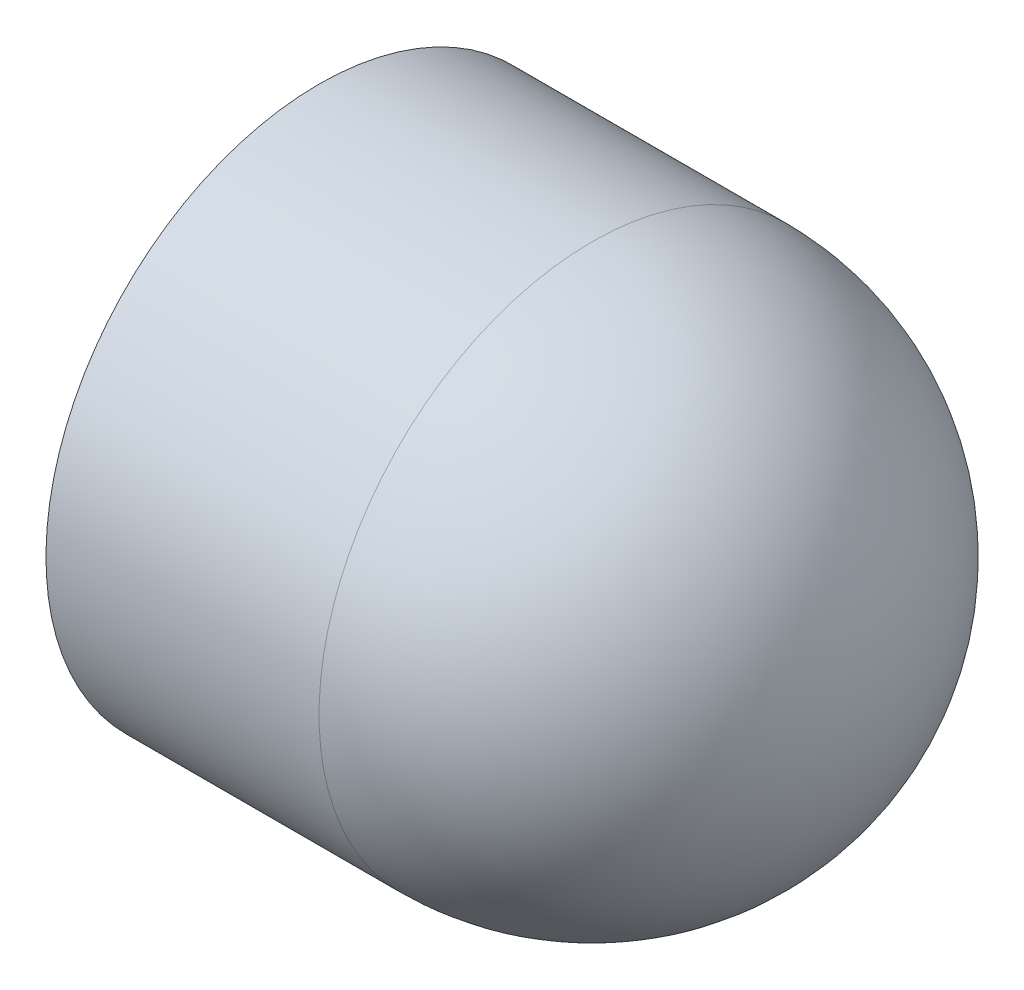
ISO-10303-21;
HEADER;
FILE_DESCRIPTION(('STEP AP214'),'2;1');
FILE_NAME('part.step','',(''),(''),'','','');
FILE_SCHEMA(('AUTOMOTIVE_DESIGN { 1 0 10303 214 1 1 1 1 }'));
ENDSEC;
DATA;
#1=APPLICATION_CONTEXT('core data for automotive mechanical design processes');
#2=APPLICATION_PROTOCOL_DEFINITION('international standard','automotive_design',2000,#1);
#3=PRODUCT_CONTEXT('',#1,'mechanical');
#4=PRODUCT('Part','Part','',(#3));
#5=PRODUCT_RELATED_PRODUCT_CATEGORY('part','',(#4));
#6=PRODUCT_DEFINITION_FORMATION('','',#4);
#7=PRODUCT_DEFINITION_CONTEXT('part definition',#1,'design');
#8=PRODUCT_DEFINITION('design','',#6,#7);
#9=PRODUCT_DEFINITION_SHAPE('','',#8);
#10=(LENGTH_UNIT() NAMED_UNIT(*) SI_UNIT(.MILLI.,.METRE.));
#11=(NAMED_UNIT(*) PLANE_ANGLE_UNIT() SI_UNIT($,.RADIAN.));
#12=(NAMED_UNIT(*) SI_UNIT($,.STERADIAN.) SOLID_ANGLE_UNIT());
#13=UNCERTAINTY_MEASURE_WITH_UNIT(LENGTH_MEASURE(1.E-05),#10,'distance_accuracy_value','');
#14=(GEOMETRIC_REPRESENTATION_CONTEXT(3) GLOBAL_UNCERTAINTY_ASSIGNED_CONTEXT((#13)) GLOBAL_UNIT_ASSIGNED_CONTEXT((#10,
#11,#12)) REPRESENTATION_CONTEXT('',''));
#15=CARTESIAN_POINT('',(0.,0.,0.));
#16=DIRECTION('',(0.,0.,1.));
#17=DIRECTION('',(1.,0.,0.));
#18=AXIS2_PLACEMENT_3D('',#15,#16,#17);
#19=CARTESIAN_POINT('',(0.,0.,0.));
#20=DIRECTION('',(-1.,0.,0.));
#21=DIRECTION('',(0.,-1.,0.));
#22=AXIS2_PLACEMENT_3D('',#19,#20,#21);
#23=PLANE('',#22);
#24=CARTESIAN_POINT('',(0.,0.,0.));
#25=DIRECTION('',(1.,0.,0.));
#26=DIRECTION('',(0.,1.,0.));
#27=AXIS2_PLACEMENT_3D('',#24,#25,#26);
#28=CIRCLE('',#27,0.8);
#29=CARTESIAN_POINT('',(0.,0.8,0.));
#30=VERTEX_POINT('',#29);
#31=EDGE_CURVE('E19',#30,#30,#28,.F.);
#32=ORIENTED_EDGE('',*,*,#31,.T.);
#33=EDGE_LOOP('',(#32));
#34=FACE_BOUND('',#33,.T.);
#35=ADVANCED_FACE('F16',(#34),#23,.T.);
#36=CARTESIAN_POINT('',(1.2,0.,0.));
#37=DIRECTION('',(1.,0.,0.));
#38=DIRECTION('',(0.,1.,0.));
#39=AXIS2_PLACEMENT_3D('',#36,#37,#38);
#40=CYLINDRICAL_SURFACE('',#39,0.8);
#41=ORIENTED_EDGE('',*,*,#31,.F.);
#42=EDGE_LOOP('',(#41));
#43=FACE_BOUND('',#42,.T.);
#44=CARTESIAN_POINT('',(-3.,0.,0.));
#45=DIRECTION('',(1.,0.,0.));
#46=DIRECTION('',(0.,1.,0.));
#47=AXIS2_PLACEMENT_3D('',#44,#45,#46);
#48=CIRCLE('',#47,0.8);
#49=CARTESIAN_POINT('',(-3.,0.8,0.));
#50=VERTEX_POINT('',#49);
#51=EDGE_CURVE('E35',#50,#50,#48,.T.);
#52=ORIENTED_EDGE('',*,*,#51,.F.);
#53=EDGE_LOOP('',(#52));
#54=FACE_BOUND('',#53,.T.);
#55=ADVANCED_FACE('F47',(#43,#54),#40,.F.);
#56=CARTESIAN_POINT('',(-3.,0.8,0.));
#57=DIRECTION('',(-1.,0.,0.));
#58=DIRECTION('',(0.,-1.,0.));
#59=AXIS2_PLACEMENT_3D('',#56,#57,#58);
#60=PLANE('',#59);
#61=CARTESIAN_POINT('',(-3.,0.,0.));
#62=DIRECTION('',(1.,0.,0.));
#63=DIRECTION('',(0.,1.,0.));
#64=AXIS2_PLACEMENT_3D('',#61,#62,#63);
#65=CIRCLE('',#64,2.1);
#66=CARTESIAN_POINT('',(-3.,2.1,0.));
#67=VERTEX_POINT('',#66);
#68=EDGE_CURVE('E25',#67,#67,#65,.T.);
#69=ORIENTED_EDGE('',*,*,#68,.F.);
#70=EDGE_LOOP('',(#69));
#71=FACE_BOUND('',#70,.T.);
#72=ORIENTED_EDGE('',*,*,#51,.T.);
#73=EDGE_LOOP('',(#72));
#74=FACE_BOUND('',#73,.T.);
#75=ADVANCED_FACE('F39',(#71,#74),#60,.T.);
#76=CARTESIAN_POINT('',(-0.9,0.,0.));
#77=DIRECTION('',(0.,1.,0.));
#78=DIRECTION('',(-1.,0.,0.));
#79=AXIS2_PLACEMENT_3D('',#76,#77,#78);
#80=SPHERICAL_SURFACE('',#79,2.1);
#81=CARTESIAN_POINT('',(-0.9,0.,0.));
#82=DIRECTION('',(1.,0.,0.));
#83=DIRECTION('',(0.,1.,0.));
#84=AXIS2_PLACEMENT_3D('',#81,#82,#83);
#85=CIRCLE('',#84,2.1);
#86=CARTESIAN_POINT('',(-0.9,-2.1,0.));
#87=VERTEX_POINT('',#86);
#88=CARTESIAN_POINT('',(-0.9,2.1,0.));
#89=VERTEX_POINT('',#88);
#90=EDGE_CURVE('E11',#87,#89,#85,.F.);
#91=ORIENTED_EDGE('',*,*,#90,.F.);
#92=CARTESIAN_POINT('',(-0.9,0.,0.));
#93=DIRECTION('',(1.,0.,0.));
#94=DIRECTION('',(0.,1.,0.));
#95=AXIS2_PLACEMENT_3D('',#92,#93,#94);
#96=CIRCLE('',#95,2.1);
#97=EDGE_CURVE('E31',#89,#87,#96,.F.);
#98=ORIENTED_EDGE('',*,*,#97,.F.);
#99=EDGE_LOOP('',(#91,#98));
#100=FACE_BOUND('',#99,.T.);
#101=ADVANCED_FACE('F37',(#100),#80,.T.);
#102=CARTESIAN_POINT('',(1.2,0.,0.));
#103=DIRECTION('',(1.,0.,0.));
#104=DIRECTION('',(0.,1.,0.));
#105=AXIS2_PLACEMENT_3D('',#102,#103,#104);
#106=CYLINDRICAL_SURFACE('',#105,2.1);
#107=ORIENTED_EDGE('',*,*,#97,.T.);
#108=ORIENTED_EDGE('',*,*,#90,.T.);
#109=EDGE_LOOP('',(#107,#108));
#110=FACE_BOUND('',#109,.T.);
#111=ORIENTED_EDGE('',*,*,#68,.T.);
#112=EDGE_LOOP('',(#111));
#113=FACE_BOUND('',#112,.T.);
#114=ADVANCED_FACE('F33',(#110,#113),#106,.T.);
#115=CLOSED_SHELL('',(#35,#55,#75,#101,#114));
#116=MANIFOLD_SOLID_BREP('B1',#115);
#117=ADVANCED_BREP_SHAPE_REPRESENTATION('',(#18,#116),#14);
#118=SHAPE_DEFINITION_REPRESENTATION(#9,#117);
ENDSEC;
END-ISO-10303-21;
